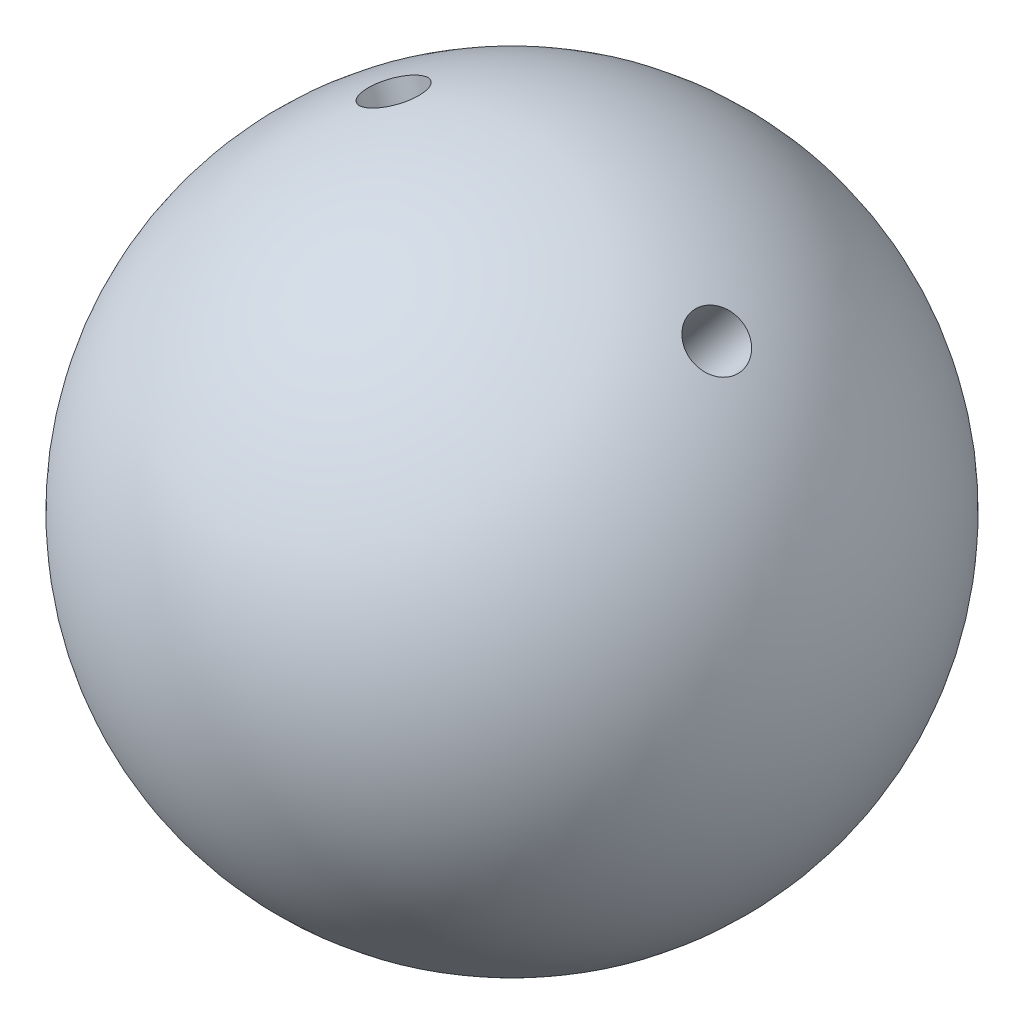
ISO-10303-21;
HEADER;
FILE_DESCRIPTION(('STEP AP214'),'2;1');
FILE_NAME('part.step','',(''),(''),'','','');
FILE_SCHEMA(('AUTOMOTIVE_DESIGN { 1 0 10303 214 1 1 1 1 }'));
ENDSEC;
DATA;
#1=APPLICATION_CONTEXT('core data for automotive mechanical design processes');
#2=APPLICATION_PROTOCOL_DEFINITION('international standard','automotive_design',2000,#1);
#3=PRODUCT_CONTEXT('',#1,'mechanical');
#4=PRODUCT('Part','Part','',(#3));
#5=PRODUCT_RELATED_PRODUCT_CATEGORY('part','',(#4));
#6=PRODUCT_DEFINITION_FORMATION('','',#4);
#7=PRODUCT_DEFINITION_CONTEXT('part definition',#1,'design');
#8=PRODUCT_DEFINITION('design','',#6,#7);
#9=PRODUCT_DEFINITION_SHAPE('','',#8);
#10=(LENGTH_UNIT() NAMED_UNIT(*) SI_UNIT(.MILLI.,.METRE.));
#11=(NAMED_UNIT(*) PLANE_ANGLE_UNIT() SI_UNIT($,.RADIAN.));
#12=(NAMED_UNIT(*) SI_UNIT($,.STERADIAN.) SOLID_ANGLE_UNIT());
#13=UNCERTAINTY_MEASURE_WITH_UNIT(LENGTH_MEASURE(1.E-05),#10,'distance_accuracy_value','');
#14=(GEOMETRIC_REPRESENTATION_CONTEXT(3) GLOBAL_UNCERTAINTY_ASSIGNED_CONTEXT((#13)) GLOBAL_UNIT_ASSIGNED_CONTEXT((#10,
#11,#12)) REPRESENTATION_CONTEXT('',''));
#15=CARTESIAN_POINT('',(0.,0.,0.));
#16=DIRECTION('',(0.,0.,1.));
#17=DIRECTION('',(1.,0.,0.));
#18=AXIS2_PLACEMENT_3D('',#15,#16,#17);
#19=CARTESIAN_POINT('',(0.,0.,0.));
#20=DIRECTION('',(0.,1.,0.));
#21=DIRECTION('',(1.,0.,0.));
#22=AXIS2_PLACEMENT_3D('',#19,#20,#21);
#23=SPHERICAL_SURFACE('',#22,60.);
#24=CARTESIAN_POINT('',(-21.0638052253571,55.9561458509435,0.475237768026475));
#25=DIRECTION('',(0.35228877640101,-0.935857597572858,-0.00794827572731468));
#26=DIRECTION('',(0.935887160416183,0.352299904865349,0.));
#27=AXIS2_PLACEMENT_3D('',#24,#25,#26);
#28=CIRCLE('',#27,4.99999999999999);
#29=CARTESIAN_POINT('',(-16.3843694232762,57.7176453752702,0.475237768026475));
#30=VERTEX_POINT('',#29);
#31=EDGE_CURVE('E36',#30,#30,#28,.T.);
#32=ORIENTED_EDGE('',*,*,#31,.T.);
#33=EDGE_LOOP('',(#32));
#34=FACE_BOUND('',#33,.T.);
#35=CARTESIAN_POINT('',(5.8646005882752,34.5636564103287,-48.4351124236204));
#36=DIRECTION('',(-0.0980845076765605,-0.578071630195355,0.810069515360955));
#37=DIRECTION('',(0.,-0.813994524295596,-0.58087254575921));
#38=AXIS2_PLACEMENT_3D('',#35,#36,#37);
#39=CIRCLE('',#38,4.99999999999999);
#40=CARTESIAN_POINT('',(5.8646005882752,30.4936837888507,-51.3394751524164));
#41=VERTEX_POINT('',#40);
#42=EDGE_CURVE('E67',#41,#41,#39,.T.);
#43=ORIENTED_EDGE('',*,*,#42,.T.);
#44=EDGE_LOOP('',(#43));
#45=FACE_BOUND('',#44,.T.);
#46=CARTESIAN_POINT('',(37.9286034856635,46.2166086156556,0.667926414078986));
#47=DIRECTION('',(-0.634349832312263,-0.772965393689338,-0.0111709625409247));
#48=DIRECTION('',(0.773013627535639,-0.634389416403042,0.));
#49=AXIS2_PLACEMENT_3D('',#46,#47,#48);
#50=CIRCLE('',#49,4.99999999999999);
#51=CARTESIAN_POINT('',(41.7936716233416,43.0446615336404,0.667926414078986));
#52=VERTEX_POINT('',#51);
#53=EDGE_CURVE('E11',#52,#52,#50,.T.);
#54=ORIENTED_EDGE('',*,*,#53,.T.);
#55=EDGE_LOOP('',(#54));
#56=FACE_BOUND('',#55,.T.);
#57=ADVANCED_FACE('F33',(#34,#45,#56),#23,.T.);
#58=CARTESIAN_POINT('',(38.0609899387358,46.3779236213602,0.670257752455488));
#59=DIRECTION('',(0.634349832312263,0.772965393689338,0.0111709625409247));
#60=DIRECTION('',(-0.773013627535639,0.634389416403042,0.));
#61=AXIS2_PLACEMENT_3D('',#58,#59,#60);
#62=CYLINDRICAL_SURFACE('',#61,4.99999999999999);
#63=CARTESIAN_POINT('',(23.6993097351861,28.8779871082336,0.417347160528952));
#64=DIRECTION('',(0.634349832312263,0.772965393689338,0.0111709625409247));
#65=DIRECTION('',(-0.773013627535639,0.634389416403042,0.));
#66=AXIS2_PLACEMENT_3D('',#63,#64,#65);
#67=CIRCLE('',#66,4.99999999999998);
#68=CARTESIAN_POINT('',(19.834241597508,32.0499341902488,0.417347160528952));
#69=VERTEX_POINT('',#68);
#70=EDGE_CURVE('E41',#69,#69,#67,.T.);
#71=ORIENTED_EDGE('',*,*,#70,.F.);
#72=EDGE_LOOP('',(#71));
#73=FACE_BOUND('',#72,.T.);
#74=ORIENTED_EDGE('',*,*,#53,.F.);
#75=EDGE_LOOP('',(#74));
#76=FACE_BOUND('',#75,.T.);
#77=ADVANCED_FACE('F85',(#73,#76),#62,.F.);
#78=CARTESIAN_POINT('',(23.6993097351861,28.8779871082336,0.417347160528952));
#79=DIRECTION('',(0.634349832312263,0.772965393689338,0.0111709625409247));
#80=DIRECTION('',(-0.773013627535639,0.634389416403042,0.));
#81=AXIS2_PLACEMENT_3D('',#78,#79,#80);
#82=CONICAL_SURFACE('',#81,4.99999999999999,1.02974425867665);
#83=CARTESIAN_POINT('',(21.7935305705703,26.5557647835384,0.38378620319158));
#84=VERTEX_POINT('',#83);
#85=VERTEX_LOOP('',#84);
#86=FACE_BOUND('',#85,.T.);
#87=ORIENTED_EDGE('',*,*,#70,.T.);
#88=EDGE_LOOP('',(#87));
#89=FACE_BOUND('',#88,.T.);
#90=ADVANCED_FACE('F77',(#86,#89),#82,.F.);
#91=CARTESIAN_POINT('',(5.88507046059363,34.6842978117213,-48.6041709216573));
#92=DIRECTION('',(0.0980845076765605,0.578071630195355,-0.810069515360955));
#93=DIRECTION('',(0.,0.813994524295596,0.58087254575921));
#94=AXIS2_PLACEMENT_3D('',#91,#92,#93);
#95=CYLINDRICAL_SURFACE('',#94,4.99999999999999);
#96=CARTESIAN_POINT('',(3.6644372067963,21.5967561040984,-30.2641970938853));
#97=DIRECTION('',(0.0980845076765605,0.578071630195355,-0.810069515360955));
#98=DIRECTION('',(0.,0.813994524295596,0.58087254575921));
#99=AXIS2_PLACEMENT_3D('',#96,#97,#98);
#100=CIRCLE('',#99,4.99999999999999);
#101=CARTESIAN_POINT('',(3.6644372067963,25.6667287255764,-27.3598343650892));
#102=VERTEX_POINT('',#101);
#103=EDGE_CURVE('E63',#102,#102,#100,.T.);
#104=ORIENTED_EDGE('',*,*,#103,.F.);
#105=EDGE_LOOP('',(#104));
#106=FACE_BOUND('',#105,.T.);
#107=ORIENTED_EDGE('',*,*,#42,.F.);
#108=EDGE_LOOP('',(#107));
#109=FACE_BOUND('',#108,.T.);
#110=ADVANCED_FACE('F74',(#106,#109),#95,.F.);
#111=CARTESIAN_POINT('',(3.6644372067963,21.5967561040984,-30.2641970938853));
#112=DIRECTION('',(0.0980845076765605,0.578071630195355,-0.810069515360955));
#113=DIRECTION('',(0.,0.813994524295596,0.58087254575921));
#114=AXIS2_PLACEMENT_3D('',#111,#112,#113);
#115=CONICAL_SURFACE('',#114,4.99999999999999,1.02974425867665);
#116=CARTESIAN_POINT('',(3.36976161679854,19.8600537162912,-27.8305027416096));
#117=VERTEX_POINT('',#116);
#118=VERTEX_LOOP('',#117);
#119=FACE_BOUND('',#118,.T.);
#120=ORIENTED_EDGE('',*,*,#103,.T.);
#121=EDGE_LOOP('',(#120));
#122=FACE_BOUND('',#121,.T.);
#123=ADVANCED_FACE('F76',(#119,#122),#115,.F.);
#124=CARTESIAN_POINT('',(-21.1373265840606,56.1514558543715,0.476896543638892));
#125=DIRECTION('',(-0.35228877640101,0.935857597572858,0.00794827572731468));
#126=DIRECTION('',(-0.935887160416183,-0.352299904865349,0.));
#127=AXIS2_PLACEMENT_3D('',#124,#125,#126);
#128=CYLINDRICAL_SURFACE('',#127,4.99999999999999);
#129=CARTESIAN_POINT('',(-13.1615086863417,34.963639845322,0.296947581172487));
#130=DIRECTION('',(-0.35228877640101,0.935857597572858,0.00794827572731468));
#131=DIRECTION('',(-0.935887160416183,-0.352299904865349,0.));
#132=AXIS2_PLACEMENT_3D('',#129,#130,#131);
#133=CIRCLE('',#132,4.99999999999999);
#134=CARTESIAN_POINT('',(-17.8409444884226,33.2021403209952,0.296947581172487));
#135=VERTEX_POINT('',#134);
#136=EDGE_CURVE('E59',#135,#135,#133,.T.);
#137=ORIENTED_EDGE('',*,*,#136,.F.);
#138=EDGE_LOOP('',(#137));
#139=FACE_BOUND('',#138,.T.);
#140=ORIENTED_EDGE('',*,*,#31,.F.);
#141=EDGE_LOOP('',(#140));
#142=FACE_BOUND('',#141,.T.);
#143=ADVANCED_FACE('F55',(#139,#142),#128,.F.);
#144=CARTESIAN_POINT('',(-13.1615086863417,34.963639845322,0.296947581172487));
#145=DIRECTION('',(-0.35228877640101,0.935857597572858,0.00794827572731468));
#146=DIRECTION('',(-0.935887160416183,-0.352299904865349,0.));
#147=AXIS2_PLACEMENT_3D('',#144,#145,#146);
#148=CONICAL_SURFACE('',#147,4.99999999999999,1.02974425867666);
#149=CARTESIAN_POINT('',(-12.1031264250179,32.1520399683256,0.273068551803903));
#150=VERTEX_POINT('',#149);
#151=VERTEX_LOOP('',#150);
#152=FACE_BOUND('',#151,.T.);
#153=ORIENTED_EDGE('',*,*,#136,.T.);
#154=EDGE_LOOP('',(#153));
#155=FACE_BOUND('',#154,.T.);
#156=ADVANCED_FACE('F52',(#152,#155),#148,.F.);
#157=CLOSED_SHELL('',(#57,#77,#90,#110,#123,#143,#156));
#158=MANIFOLD_SOLID_BREP('B2',#157);
#159=ADVANCED_BREP_SHAPE_REPRESENTATION('',(#18,#158),#14);
#160=SHAPE_DEFINITION_REPRESENTATION(#9,#159);
ENDSEC;
END-ISO-10303-21;
